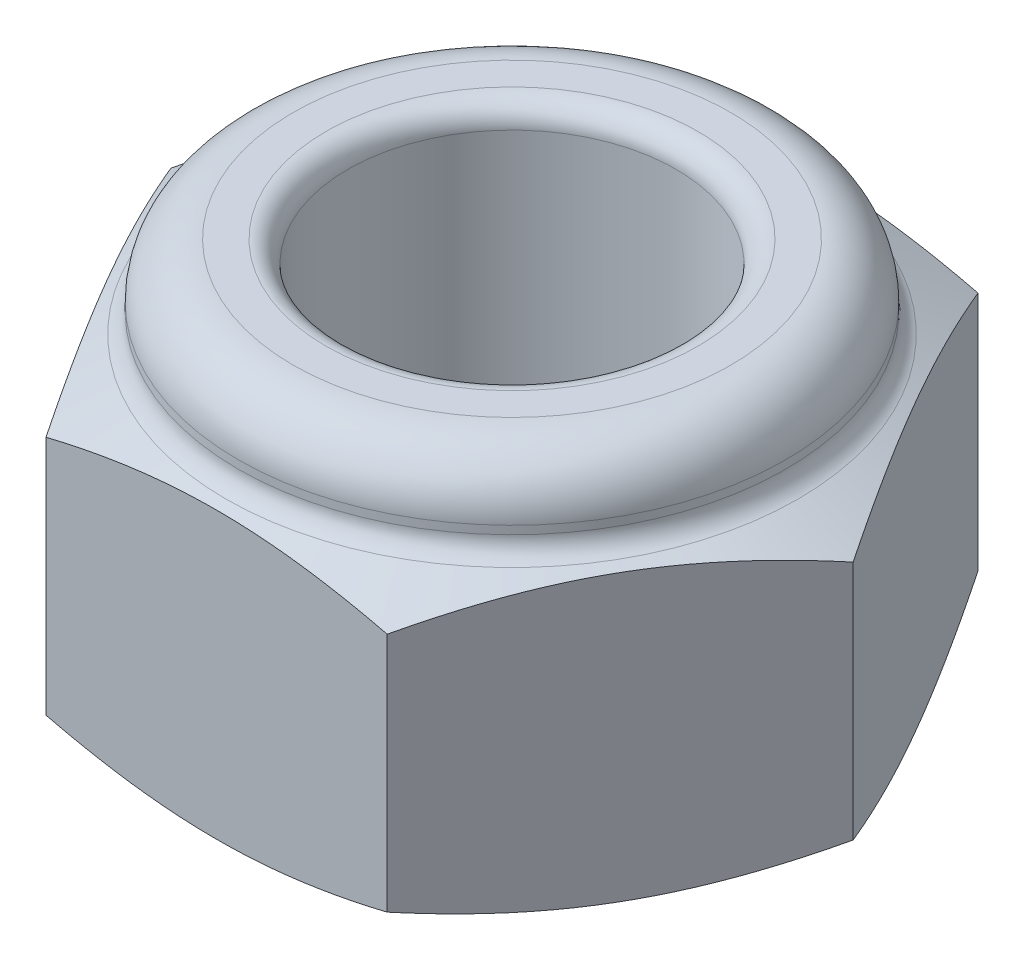
ISO-10303-21;
HEADER;
FILE_DESCRIPTION(('STEP AP214'),'2;1');
FILE_NAME('part.step','',(''),(''),'','','');
FILE_SCHEMA(('AUTOMOTIVE_DESIGN { 1 0 10303 214 1 1 1 1 }'));
ENDSEC;
DATA;
#1=APPLICATION_CONTEXT('core data for automotive mechanical design processes');
#2=APPLICATION_PROTOCOL_DEFINITION('international standard','automotive_design',2000,#1);
#3=PRODUCT_CONTEXT('',#1,'mechanical');
#4=PRODUCT('Part','Part','',(#3));
#5=PRODUCT_RELATED_PRODUCT_CATEGORY('part','',(#4));
#6=PRODUCT_DEFINITION_FORMATION('','',#4);
#7=PRODUCT_DEFINITION_CONTEXT('part definition',#1,'design');
#8=PRODUCT_DEFINITION('design','',#6,#7);
#9=PRODUCT_DEFINITION_SHAPE('','',#8);
#10=(LENGTH_UNIT() NAMED_UNIT(*) SI_UNIT(.MILLI.,.METRE.));
#11=(NAMED_UNIT(*) PLANE_ANGLE_UNIT() SI_UNIT($,.RADIAN.));
#12=(NAMED_UNIT(*) SI_UNIT($,.STERADIAN.) SOLID_ANGLE_UNIT());
#13=UNCERTAINTY_MEASURE_WITH_UNIT(LENGTH_MEASURE(1.E-05),#10,'distance_accuracy_value','');
#14=(GEOMETRIC_REPRESENTATION_CONTEXT(3) GLOBAL_UNCERTAINTY_ASSIGNED_CONTEXT((#13)) GLOBAL_UNIT_ASSIGNED_CONTEXT((#10,
#11,#12)) REPRESENTATION_CONTEXT('',''));
#15=CARTESIAN_POINT('',(0.,0.,0.));
#16=DIRECTION('',(0.,0.,1.));
#17=DIRECTION('',(1.,0.,0.));
#18=AXIS2_PLACEMENT_3D('',#15,#16,#17);
#19=CARTESIAN_POINT('',(1.55884572681199,1.4,2.7));
#20=DIRECTION('',(-0.866025403784439,0.,-0.5));
#21=DIRECTION('',(-0.5,0.,0.866025403784439));
#22=AXIS2_PLACEMENT_3D('',#19,#20,#21);
#23=PLANE('',#22);
#24=CARTESIAN_POINT('',(3.11780692367782,-1.09994391546074,-0.000200000000000864));
#25=CARTESIAN_POINT('',(3.07256028865668,-1.12192030262385,0.0781694707281279));
#26=CARTESIAN_POINT('',(3.02714131524047,-1.14254891267692,0.156837440312636));
#27=CARTESIAN_POINT('',(2.93595040530064,-1.18065333296517,0.314784729516853));
#28=CARTESIAN_POINT('',(2.8901782962198,-1.19812748468401,0.394064348014452));
#29=CARTESIAN_POINT('',(2.79826244016689,-1.22946144459945,0.553267280719281));
#30=CARTESIAN_POINT('',(2.75211829764663,-1.24331667166284,0.633191280036078));
#31=CARTESIAN_POINT('',(2.65957440015918,-1.26693209007472,0.793482012414777));
#32=CARTESIAN_POINT('',(2.61317469231809,-1.27669301238165,0.873848663851907));
#33=CARTESIAN_POINT('',(2.52120907705397,-1.29159532259173,1.03313778203869));
#34=CARTESIAN_POINT('',(2.47564711379912,-1.29683302390061,1.11205341728868));
#35=CARTESIAN_POINT('',(2.38444615418405,-1.30284150252472,1.27001811304101));
#36=CARTESIAN_POINT('',(2.3388071538454,-1.30361204161315,1.34906718043421));
#37=CARTESIAN_POINT('',(2.24761264293103,-1.30065577348523,1.5070207067093));
#38=CARTESIAN_POINT('',(2.20205709465482,-1.29693354152126,1.58592523089034));
#39=CARTESIAN_POINT('',(2.11109193389101,-1.28514782232476,1.74348151105194));
#40=CARTESIAN_POINT('',(2.06568230893312,-1.27708471654445,1.82213328863166));
#41=CARTESIAN_POINT('',(1.98169142278206,-1.25838651295584,1.96760977081801));
#42=CARTESIAN_POINT('',(1.94307921975688,-1.24829730119537,2.03448806824979));
#43=CARTESIAN_POINT('',(1.86605523389241,-1.22541324415785,2.16789752516853));
#44=CARTESIAN_POINT('',(1.82764345852041,-1.21261829880095,2.23442867172175));
#45=CARTESIAN_POINT('',(1.75066867636476,-1.18445557965474,2.36775290531687));
#46=CARTESIAN_POINT('',(1.71210788697121,-1.16906378091678,2.43454215172648));
#47=CARTESIAN_POINT('',(1.63523454688317,-1.13608244562171,2.56769068250648));
#48=CARTESIAN_POINT('',(1.59692191900575,-1.11849363067909,2.63405010056164));
#49=CARTESIAN_POINT('',(1.55873025675815,-1.09994391546075,2.7002));
#50=B_SPLINE_CURVE_WITH_KNOTS('',3,(#24,#25,#26,#27,#28,#29,#30,#31,#32,#33,#34,#35,#36,#37,#38,
#39,#40,#41,#42,#43,#44,#45,#46,#47,#48,#49),.UNSPECIFIED.,.F.,.F.,(4,2,2,2,2,2,2,2,2,2,2,2,4),
(0.,0.279385541508917,0.558917550140784,0.838801717024647,1.11863589474765,1.39235324880075,
1.66608519964082,1.93953862820556,2.2129680311007,2.44655992287335,2.68016045626954,
2.91605430501085,3.15187087666844),.UNSPECIFIED.);
#51=CARTESIAN_POINT('',(3.11769145362398,-1.1,0.));
#52=VERTEX_POINT('',#51);
#53=CARTESIAN_POINT('',(1.55884572681199,-1.1,2.7));
#54=VERTEX_POINT('',#53);
#55=EDGE_CURVE('E48',#52,#54,#50,.T.);
#56=ORIENTED_EDGE('',*,*,#55,.F.);
#57=DIRECTION('',(0.,-1.,0.));
#58=VECTOR('',#57,1.);
#59=CARTESIAN_POINT('',(3.11769145362398,1.4,0.));
#60=LINE('',#59,#58);
#61=CARTESIAN_POINT('',(3.11769145362398,1.1,0.));
#62=VERTEX_POINT('',#61);
#63=EDGE_CURVE('E102',#62,#52,#60,.T.);
#64=ORIENTED_EDGE('',*,*,#63,.F.);
#65=CARTESIAN_POINT('',(1.55873025675815,1.09994391546074,2.7002));
#66=CARTESIAN_POINT('',(1.60397689177929,1.12192030262385,2.62183052927187));
#67=CARTESIAN_POINT('',(1.6493958651955,1.14254891267692,2.54316255968736));
#68=CARTESIAN_POINT('',(1.74058677513533,1.18065333296517,2.38521527048315));
#69=CARTESIAN_POINT('',(1.78635888421617,1.19812748468401,2.30593565198555));
#70=CARTESIAN_POINT('',(1.87827474026908,1.22946144459945,2.14673271928072));
#71=CARTESIAN_POINT('',(1.92441888278934,1.24331667166284,2.06680871996392));
#72=CARTESIAN_POINT('',(2.01696278027679,1.26693209007472,1.90651798758522));
#73=CARTESIAN_POINT('',(2.06336248811788,1.27669301238165,1.82615133614809));
#74=CARTESIAN_POINT('',(2.155328103382,1.29159532259173,1.66686221796131));
#75=CARTESIAN_POINT('',(2.20089006663685,1.29683302390061,1.58794658271132));
#76=CARTESIAN_POINT('',(2.29209102625192,1.30284150252472,1.42998188695899));
#77=CARTESIAN_POINT('',(2.33773002659057,1.30361204161315,1.35093281956579));
#78=CARTESIAN_POINT('',(2.42892453750494,1.30065577348523,1.1929792932907));
#79=CARTESIAN_POINT('',(2.47448008578115,1.29693354152126,1.11407476910966));
#80=CARTESIAN_POINT('',(2.56544524654496,1.28514782232476,0.956518488948062));
#81=CARTESIAN_POINT('',(2.61085487150285,1.27708471654445,0.877866711368344));
#82=CARTESIAN_POINT('',(2.69484575765391,1.25838651295584,0.73239022918199));
#83=CARTESIAN_POINT('',(2.73345796067909,1.24829730119537,0.665511931750207));
#84=CARTESIAN_POINT('',(2.81048194654356,1.22541324415785,0.532102474831471));
#85=CARTESIAN_POINT('',(2.84889372191556,1.21261829880095,0.465571328278254));
#86=CARTESIAN_POINT('',(2.92586850407121,1.18445557965474,0.332247094683126));
#87=CARTESIAN_POINT('',(2.96442929346476,1.16906378091678,0.26545784827352));
#88=CARTESIAN_POINT('',(3.0413026335528,1.13608244562171,0.132309317493521));
#89=CARTESIAN_POINT('',(3.07961526143022,1.11849363067909,0.0659498994383551));
#90=CARTESIAN_POINT('',(3.11780692367782,1.09994391546075,-0.000200000000001502));
#91=B_SPLINE_CURVE_WITH_KNOTS('',3,(#65,#66,#67,#68,#69,#70,#71,#72,#73,#74,#75,#76,#77,#78,#79,
#80,#81,#82,#83,#84,#85,#86,#87,#88,#89,#90),.UNSPECIFIED.,.F.,.F.,(4,2,2,2,2,2,2,2,2,2,2,2,4),
(0.,0.279385541508917,0.558917550140785,0.838801717024647,1.11863589474765,1.39235324880075,
1.66608519964082,1.93953862820556,2.2129680311007,2.44655992287335,2.68016045626954,
2.91605430501085,3.15187087666844),.UNSPECIFIED.);
#92=CARTESIAN_POINT('',(1.55884572681199,1.1,2.7));
#93=VERTEX_POINT('',#92);
#94=EDGE_CURVE('E146',#93,#62,#91,.T.);
#95=ORIENTED_EDGE('',*,*,#94,.F.);
#96=DIRECTION('',(0.,-1.,0.));
#97=VECTOR('',#96,1.);
#98=CARTESIAN_POINT('',(1.55884572681199,1.4,2.7));
#99=LINE('',#98,#97);
#100=EDGE_CURVE('E231',#93,#54,#99,.T.);
#101=ORIENTED_EDGE('',*,*,#100,.T.);
#102=EDGE_LOOP('',(#56,#64,#95,#101));
#103=FACE_BOUND('',#102,.T.);
#104=ADVANCED_FACE('F33',(#103),#23,.F.);
#105=CARTESIAN_POINT('',(3.11769145362398,1.4,0.));
#106=DIRECTION('',(-0.866025403784438,0.,0.5));
#107=DIRECTION('',(0.5,0.,0.866025403784438));
#108=AXIS2_PLACEMENT_3D('',#105,#106,#107);
#109=PLANE('',#108);
#110=CARTESIAN_POINT('',(1.55873025675815,-1.09994391546074,-2.7002));
#111=CARTESIAN_POINT('',(1.60397689177928,-1.12192030262385,-2.62183052927187));
#112=CARTESIAN_POINT('',(1.6493958651955,-1.14254891267692,-2.54316255968736));
#113=CARTESIAN_POINT('',(1.74058677513533,-1.18065333296517,-2.38521527048315));
#114=CARTESIAN_POINT('',(1.78635888421617,-1.19812748468401,-2.30593565198555));
#115=CARTESIAN_POINT('',(1.87827474026908,-1.22946144459945,-2.14673271928072));
#116=CARTESIAN_POINT('',(1.92441888278934,-1.24331667166284,-2.06680871996392));
#117=CARTESIAN_POINT('',(2.01696278027679,-1.26693209007472,-1.90651798758522));
#118=CARTESIAN_POINT('',(2.06336248811788,-1.27669301238165,-1.82615133614809));
#119=CARTESIAN_POINT('',(2.155328103382,-1.29159532259173,-1.66686221796131));
#120=CARTESIAN_POINT('',(2.20089006663685,-1.29683302390061,-1.58794658271132));
#121=CARTESIAN_POINT('',(2.29209102625192,-1.30284150252473,-1.42998188695899));
#122=CARTESIAN_POINT('',(2.33773002659057,-1.30361204161315,-1.35093281956579));
#123=CARTESIAN_POINT('',(2.42892453750494,-1.30065577348523,-1.1929792932907));
#124=CARTESIAN_POINT('',(2.47448008578115,-1.29693354152126,-1.11407476910966));
#125=CARTESIAN_POINT('',(2.56544524654496,-1.28514782232476,-0.956518488948063));
#126=CARTESIAN_POINT('',(2.61085487150285,-1.27708471654445,-0.877866711368345));
#127=CARTESIAN_POINT('',(2.69484575765391,-1.25838651295584,-0.732390229181991));
#128=CARTESIAN_POINT('',(2.73345796067909,-1.24829730119537,-0.665511931750209));
#129=CARTESIAN_POINT('',(2.81048194654356,-1.22541324415785,-0.532102474831473));
#130=CARTESIAN_POINT('',(2.84889372191556,-1.21261829880095,-0.465571328278256));
#131=CARTESIAN_POINT('',(2.92586850407121,-1.18445557965474,-0.332247094683128));
#132=CARTESIAN_POINT('',(2.96442929346476,-1.16906378091678,-0.265457848273522));
#133=CARTESIAN_POINT('',(3.0413026335528,-1.13608244562171,-0.132309317493523));
#134=CARTESIAN_POINT('',(3.07961526143022,-1.11849363067909,-0.0659498994383571));
#135=CARTESIAN_POINT('',(3.11780692367782,-1.09994391546075,0.000199999999999769));
#136=B_SPLINE_CURVE_WITH_KNOTS('',3,(#110,#111,#112,#113,#114,#115,#116,#117,#118,#119,#120,
#121,#122,#123,#124,#125,#126,#127,#128,#129,#130,#131,#132,#133,#134,#135),.UNSPECIFIED.,.F.,
.F.,(4,2,2,2,2,2,2,2,2,2,2,2,4),(0.,0.279385541508917,0.558917550140784,0.838801717024647,
1.11863589474765,1.39235324880074,1.66608519964081,1.93953862820556,2.2129680311007,
2.44655992287335,2.68016045626954,2.91605430501084,3.15187087666844),.UNSPECIFIED.);
#137=CARTESIAN_POINT('',(1.55884572681199,-1.1,-2.7));
#138=VERTEX_POINT('',#137);
#139=EDGE_CURVE('E87',#138,#52,#136,.T.);
#140=ORIENTED_EDGE('',*,*,#139,.F.);
#141=DIRECTION('',(0.,-1.,0.));
#142=VECTOR('',#141,1.);
#143=CARTESIAN_POINT('',(1.55884572681199,1.4,-2.7));
#144=LINE('',#143,#142);
#145=CARTESIAN_POINT('',(1.55884572681199,1.1,-2.7));
#146=VERTEX_POINT('',#145);
#147=EDGE_CURVE('E100',#146,#138,#144,.T.);
#148=ORIENTED_EDGE('',*,*,#147,.F.);
#149=CARTESIAN_POINT('',(3.11780692367782,1.09994391546074,0.000199999999999368));
#150=CARTESIAN_POINT('',(3.07256028865668,1.12192030262385,-0.0781694707281294));
#151=CARTESIAN_POINT('',(3.02714131524047,1.14254891267692,-0.156837440312637));
#152=CARTESIAN_POINT('',(2.93595040530064,1.18065333296517,-0.314784729516854));
#153=CARTESIAN_POINT('',(2.8901782962198,1.19812748468401,-0.394064348014453));
#154=CARTESIAN_POINT('',(2.79826244016689,1.22946144459945,-0.553267280719283));
#155=CARTESIAN_POINT('',(2.75211829764663,1.24331667166284,-0.633191280036079));
#156=CARTESIAN_POINT('',(2.65957440015918,1.26693209007472,-0.793482012414778));
#157=CARTESIAN_POINT('',(2.61317469231809,1.27669301238165,-0.873848663851909));
#158=CARTESIAN_POINT('',(2.52120907705397,1.29159532259173,-1.0331377820387));
#159=CARTESIAN_POINT('',(2.47564711379911,1.29683302390061,-1.11205341728868));
#160=CARTESIAN_POINT('',(2.38444615418405,1.30284150252473,-1.27001811304101));
#161=CARTESIAN_POINT('',(2.3388071538454,1.30361204161315,-1.34906718043422));
#162=CARTESIAN_POINT('',(2.24761264293103,1.30065577348523,-1.5070207067093));
#163=CARTESIAN_POINT('',(2.20205709465482,1.29693354152126,-1.58592523089034));
#164=CARTESIAN_POINT('',(2.11109193389101,1.28514782232476,-1.74348151105194));
#165=CARTESIAN_POINT('',(2.06568230893311,1.27708471654445,-1.82213328863166));
#166=CARTESIAN_POINT('',(1.98169142278206,1.25838651295584,-1.96760977081801));
#167=CARTESIAN_POINT('',(1.94307921975688,1.24829730119537,-2.03448806824979));
#168=CARTESIAN_POINT('',(1.86605523389241,1.22541324415785,-2.16789752516853));
#169=CARTESIAN_POINT('',(1.82764345852041,1.21261829880095,-2.23442867172175));
#170=CARTESIAN_POINT('',(1.75066867636476,1.18445557965474,-2.36775290531687));
#171=CARTESIAN_POINT('',(1.71210788697121,1.16906378091678,-2.43454215172648));
#172=CARTESIAN_POINT('',(1.63523454688317,1.13608244562171,-2.56769068250648));
#173=CARTESIAN_POINT('',(1.59692191900575,1.11849363067909,-2.63405010056164));
#174=CARTESIAN_POINT('',(1.55873025675815,1.09994391546075,-2.7002));
#175=B_SPLINE_CURVE_WITH_KNOTS('',3,(#149,#150,#151,#152,#153,#154,#155,#156,#157,#158,#159,
#160,#161,#162,#163,#164,#165,#166,#167,#168,#169,#170,#171,#172,#173,#174),.UNSPECIFIED.,.F.,
.F.,(4,2,2,2,2,2,2,2,2,2,2,2,4),(0.,0.279385541508917,0.558917550140784,0.838801717024648,
1.11863589474765,1.39235324880075,1.66608519964082,1.93953862820556,2.2129680311007,
2.44655992287335,2.68016045626954,2.91605430501084,3.15187087666844),.UNSPECIFIED.);
#176=EDGE_CURVE('E221',#62,#146,#175,.T.);
#177=ORIENTED_EDGE('',*,*,#176,.F.);
#178=ORIENTED_EDGE('',*,*,#63,.T.);
#179=EDGE_LOOP('',(#140,#148,#177,#178));
#180=FACE_BOUND('',#179,.T.);
#181=ADVANCED_FACE('F98',(#180),#109,.F.);
#182=CARTESIAN_POINT('',(1.55884572681199,1.4,-2.7));
#183=DIRECTION('',(0.,0.,1.));
#184=DIRECTION('',(1.,0.,0.));
#185=AXIS2_PLACEMENT_3D('',#182,#183,#184);
#186=PLANE('',#185);
#187=CARTESIAN_POINT('',(-4.69113767948515,0.0146137083795435,-2.7));
#188=CARTESIAN_POINT('',(-4.55468747732765,-0.0428071602979565,-2.7));
#189=CARTESIAN_POINT('',(-4.41802239054629,-0.0997259467058353,-2.7));
#190=CARTESIAN_POINT('',(-4.14413431800298,-0.212248994777574,-2.7));
#191=CARTESIAN_POINT('',(-4.00691126981511,-0.267853104329405,-2.7));
#192=CARTESIAN_POINT('',(-3.73131800682273,-0.377619230758513,-2.7));
#193=CARTESIAN_POINT('',(-3.59294544377368,-0.431775371253652,-2.7));
#194=CARTESIAN_POINT('',(-3.31539674486345,-0.537980683947498,-2.7));
#195=CARTESIAN_POINT('',(-3.17622063657551,-0.590029927958033,-2.7));
#196=CARTESIAN_POINT('',(-2.89745778983694,-0.691207619077893,-2.7));
#197=CARTESIAN_POINT('',(-2.75787514043473,-0.740347271943029,-2.7));
#198=CARTESIAN_POINT('',(-2.47751012828499,-0.8351317487188,-2.7));
#199=CARTESIAN_POINT('',(-2.33672768068775,-0.880776323139671,-2.7));
#200=CARTESIAN_POINT('',(-2.05386412158284,-0.967442259910974,-2.7));
#201=CARTESIAN_POINT('',(-1.91178426862915,-1.00846767503729,-2.7));
#202=CARTESIAN_POINT('',(-1.62605040318147,-1.08452089412323,-2.7));
#203=CARTESIAN_POINT('',(-1.48239666738035,-1.11954973485076,-2.7));
#204=CARTESIAN_POINT('',(-1.14083641452659,-1.19318445404867,-2.7));
#205=CARTESIAN_POINT('',(-0.942170311485041,-1.22847087037316,-2.7));
#206=CARTESIAN_POINT('',(-0.642434964040471,-1.26706851937335,-2.7));
#207=CARTESIAN_POINT('',(-0.542272946980121,-1.27754445347769,-2.7));
#208=CARTESIAN_POINT('',(-0.341532054065742,-1.29328911490717,-2.7));
#209=CARTESIAN_POINT('',(-0.240953187924242,-1.2985579628794,-2.7));
#210=CARTESIAN_POINT('',(-0.0397183499847793,-1.30363007169235,-2.7));
#211=CARTESIAN_POINT('',(0.0609375370085431,-1.30343667399282,-2.7));
#212=CARTESIAN_POINT('',(0.26208975057184,-1.29760326538065,-2.7));
#213=CARTESIAN_POINT('',(0.362586076036933,-1.29196321691611,-2.7));
#214=CARTESIAN_POINT('',(0.563218857218127,-1.27549946871654,-2.7));
#215=CARTESIAN_POINT('',(0.663355008872786,-1.26467211314156,-2.7));
#216=CARTESIAN_POINT('',(0.86300881533064,-1.2382979795293,-2.7));
#217=CARTESIAN_POINT('',(0.962526376134903,-1.22275050130456,-2.7));
#218=CARTESIAN_POINT('',(1.21794777486023,-1.17735578612481,-2.7));
#219=CARTESIAN_POINT('',(1.373304245304,-1.14443068445732,-2.7));
#220=CARTESIAN_POINT('',(1.68210258926081,-1.07058061440098,-2.7));
#221=CARTESIAN_POINT('',(1.83554386139707,-1.02965319731164,-2.7));
#222=CARTESIAN_POINT('',(2.14099571520461,-0.941689757380214,-2.7));
#223=CARTESIAN_POINT('',(2.29300259402951,-0.894641024869303,-2.7));
#224=CARTESIAN_POINT('',(2.59551288665667,-0.796036354432129,-2.7));
#225=CARTESIAN_POINT('',(2.74601647302029,-0.744480940605079,-2.7));
#226=CARTESIAN_POINT('',(3.04789046875134,-0.637244652095412,-2.7));
#227=CARTESIAN_POINT('',(3.19924397946193,-0.581516501365703,-2.7));
#228=CARTESIAN_POINT('',(3.50095709426521,-0.467421134591493,-2.7));
#229=CARTESIAN_POINT('',(3.65131664767578,-0.409053785145371,-2.7));
#230=CARTESIAN_POINT('',(3.95029254085544,-0.290673618723429,-2.7));
#231=CARTESIAN_POINT('',(4.09891389878789,-0.230673425321061,-2.7));
#232=CARTESIAN_POINT('',(4.39548599142938,-0.109104685009477,-2.7));
#233=CARTESIAN_POINT('',(4.54343683272577,-0.0475363984628555,-2.7));
#234=CARTESIAN_POINT('',(4.69113767948515,0.0146137083795442,-2.7));
#235=B_SPLINE_CURVE_WITH_KNOTS('',3,(#187,#188,#189,#190,#191,#192,#193,#194,#195,#196,#197,
#198,#199,#200,#201,#202,#203,#204,#205,#206,#207,#208,#209,#210,#211,#212,#213,#214,#215,#216,
#217,#218,#219,#220,#221,#222,#223,#224,#225,#226,#227,#228,#229,#230,#231,#232,#233,#234),
.UNSPECIFIED.,.F.,.F.,(4,2,2,2,2,2,2,2,2,2,2,2,2,2,2,2,2,2,2,2,2,2,2,4),(0.,0.444123678734628,
0.888298494895089,1.33406370933169,1.77981371741346,2.22371728923289,2.66765251881139,
3.1111951605473,3.55466103908647,4.15914990134108,4.461160470823,4.76316404261981,
5.06498287155266,5.36680378138888,5.66883771808473,5.97091648069084,6.44703576594981,
6.92330097188916,7.40057131594465,7.87778623005908,8.36161550819059,8.84546926947997,
9.32628684560132,9.80702510173027),.UNSPECIFIED.);
#236=CARTESIAN_POINT('',(-1.55884572681199,-1.1,-2.7));
#237=VERTEX_POINT('',#236);
#238=EDGE_CURVE('E84',#237,#138,#235,.T.);
#239=ORIENTED_EDGE('',*,*,#238,.F.);
#240=DIRECTION('',(0.,-1.,0.));
#241=VECTOR('',#240,1.);
#242=CARTESIAN_POINT('',(-1.55884572681199,1.4,-2.7));
#243=LINE('',#242,#241);
#244=CARTESIAN_POINT('',(-1.55884572681199,1.1,-2.7));
#245=VERTEX_POINT('',#244);
#246=EDGE_CURVE('E107',#245,#237,#243,.T.);
#247=ORIENTED_EDGE('',*,*,#246,.F.);
#248=CARTESIAN_POINT('',(4.69113767948515,-0.0146137083795435,-2.7));
#249=CARTESIAN_POINT('',(4.55468747732765,0.0428071602979565,-2.7));
#250=CARTESIAN_POINT('',(4.41802239054629,0.0997259467058353,-2.7));
#251=CARTESIAN_POINT('',(4.14413431800298,0.212248994777574,-2.7));
#252=CARTESIAN_POINT('',(4.00691126981511,0.267853104329405,-2.7));
#253=CARTESIAN_POINT('',(3.73131800682273,0.377619230758513,-2.7));
#254=CARTESIAN_POINT('',(3.59294544377368,0.431775371253652,-2.7));
#255=CARTESIAN_POINT('',(3.31539674486345,0.537980683947498,-2.7));
#256=CARTESIAN_POINT('',(3.17622063657551,0.590029927958033,-2.7));
#257=CARTESIAN_POINT('',(2.89745778983694,0.691207619077893,-2.7));
#258=CARTESIAN_POINT('',(2.75787514043473,0.740347271943029,-2.7));
#259=CARTESIAN_POINT('',(2.47751012828499,0.8351317487188,-2.7));
#260=CARTESIAN_POINT('',(2.33672768068775,0.880776323139671,-2.7));
#261=CARTESIAN_POINT('',(2.05386412158284,0.967442259910974,-2.7));
#262=CARTESIAN_POINT('',(1.91178426862915,1.00846767503729,-2.7));
#263=CARTESIAN_POINT('',(1.62605040318147,1.08452089412323,-2.7));
#264=CARTESIAN_POINT('',(1.48239666738035,1.11954973485076,-2.7));
#265=CARTESIAN_POINT('',(1.14083641452659,1.19318445404867,-2.7));
#266=CARTESIAN_POINT('',(0.942170311485041,1.22847087037316,-2.7));
#267=CARTESIAN_POINT('',(0.642434964040471,1.26706851937335,-2.7));
#268=CARTESIAN_POINT('',(0.542272946980121,1.27754445347769,-2.7));
#269=CARTESIAN_POINT('',(0.341532054065742,1.29328911490717,-2.7));
#270=CARTESIAN_POINT('',(0.240953187924242,1.2985579628794,-2.7));
#271=CARTESIAN_POINT('',(0.0397183499847793,1.30363007169235,-2.7));
#272=CARTESIAN_POINT('',(-0.0609375370085431,1.30343667399282,-2.7));
#273=CARTESIAN_POINT('',(-0.26208975057184,1.29760326538065,-2.7));
#274=CARTESIAN_POINT('',(-0.362586076036933,1.29196321691611,-2.7));
#275=CARTESIAN_POINT('',(-0.563218857218127,1.27549946871654,-2.7));
#276=CARTESIAN_POINT('',(-0.663355008872786,1.26467211314156,-2.7));
#277=CARTESIAN_POINT('',(-0.86300881533064,1.2382979795293,-2.7));
#278=CARTESIAN_POINT('',(-0.962526376134903,1.22275050130456,-2.7));
#279=CARTESIAN_POINT('',(-1.21794777486023,1.17735578612481,-2.7));
#280=CARTESIAN_POINT('',(-1.373304245304,1.14443068445732,-2.7));
#281=CARTESIAN_POINT('',(-1.68210258926081,1.07058061440098,-2.7));
#282=CARTESIAN_POINT('',(-1.83554386139707,1.02965319731164,-2.7));
#283=CARTESIAN_POINT('',(-2.14099571520461,0.941689757380214,-2.7));
#284=CARTESIAN_POINT('',(-2.29300259402951,0.894641024869303,-2.7));
#285=CARTESIAN_POINT('',(-2.59551288665667,0.796036354432129,-2.7));
#286=CARTESIAN_POINT('',(-2.74601647302029,0.744480940605079,-2.7));
#287=CARTESIAN_POINT('',(-3.04789046875134,0.637244652095412,-2.7));
#288=CARTESIAN_POINT('',(-3.19924397946193,0.581516501365703,-2.7));
#289=CARTESIAN_POINT('',(-3.50095709426521,0.467421134591493,-2.7));
#290=CARTESIAN_POINT('',(-3.65131664767578,0.409053785145371,-2.7));
#291=CARTESIAN_POINT('',(-3.95029254085544,0.290673618723429,-2.7));
#292=CARTESIAN_POINT('',(-4.09891389878789,0.230673425321061,-2.7));
#293=CARTESIAN_POINT('',(-4.39548599142938,0.109104685009477,-2.7));
#294=CARTESIAN_POINT('',(-4.54343683272577,0.0475363984628555,-2.7));
#295=CARTESIAN_POINT('',(-4.69113767948515,-0.0146137083795442,-2.7));
#296=B_SPLINE_CURVE_WITH_KNOTS('',3,(#248,#249,#250,#251,#252,#253,#254,#255,#256,#257,#258,
#259,#260,#261,#262,#263,#264,#265,#266,#267,#268,#269,#270,#271,#272,#273,#274,#275,#276,#277,
#278,#279,#280,#281,#282,#283,#284,#285,#286,#287,#288,#289,#290,#291,#292,#293,#294,#295),
.UNSPECIFIED.,.F.,.F.,(4,2,2,2,2,2,2,2,2,2,2,2,2,2,2,2,2,2,2,2,2,2,2,4),(0.,0.444123678734628,
0.888298494895089,1.33406370933169,1.77981371741346,2.22371728923289,2.66765251881139,
3.1111951605473,3.55466103908647,4.15914990134108,4.461160470823,4.76316404261981,
5.06498287155266,5.36680378138888,5.66883771808473,5.97091648069084,6.44703576594981,
6.92330097188916,7.40057131594465,7.87778623005908,8.36161550819059,8.84546926947997,
9.32628684560132,9.80702510173027),.UNSPECIFIED.);
#297=EDGE_CURVE('E106',#146,#245,#296,.T.);
#298=ORIENTED_EDGE('',*,*,#297,.F.);
#299=ORIENTED_EDGE('',*,*,#147,.T.);
#300=EDGE_LOOP('',(#239,#247,#298,#299));
#301=FACE_BOUND('',#300,.T.);
#302=ADVANCED_FACE('F105',(#301),#186,.F.);
#303=CARTESIAN_POINT('',(-1.55884572681199,1.4,-2.7));
#304=DIRECTION('',(0.866025403784439,0.,0.5));
#305=DIRECTION('',(0.5,0.,-0.866025403784439));
#306=AXIS2_PLACEMENT_3D('',#303,#304,#305);
#307=PLANE('',#306);
#308=CARTESIAN_POINT('',(-3.11780692367782,-1.09994391546074,0.000199999999999775));
#309=CARTESIAN_POINT('',(-3.07256028865668,-1.12192030262385,-0.0781694707281291));
#310=CARTESIAN_POINT('',(-3.02714131524047,-1.14254891267692,-0.156837440312637));
#311=CARTESIAN_POINT('',(-2.93595040530064,-1.18065333296517,-0.314784729516854));
#312=CARTESIAN_POINT('',(-2.8901782962198,-1.19812748468401,-0.394064348014453));
#313=CARTESIAN_POINT('',(-2.79826244016689,-1.22946144459945,-0.553267280719282));
#314=CARTESIAN_POINT('',(-2.75211829764663,-1.24331667166284,-0.633191280036078));
#315=CARTESIAN_POINT('',(-2.65957440015918,-1.26693209007472,-0.793482012414778));
#316=CARTESIAN_POINT('',(-2.61317469231809,-1.27669301238165,-0.873848663851908));
#317=CARTESIAN_POINT('',(-2.52120907705397,-1.29159532259173,-1.03313778203869));
#318=CARTESIAN_POINT('',(-2.47564711379911,-1.29683302390061,-1.11205341728868));
#319=CARTESIAN_POINT('',(-2.38444615418405,-1.30284150252473,-1.27001811304101));
#320=CARTESIAN_POINT('',(-2.3388071538454,-1.30361204161315,-1.34906718043422));
#321=CARTESIAN_POINT('',(-2.24761264293103,-1.30065577348523,-1.5070207067093));
#322=CARTESIAN_POINT('',(-2.20205709465482,-1.29693354152126,-1.58592523089034));
#323=CARTESIAN_POINT('',(-2.11109193389101,-1.28514782232476,-1.74348151105194));
#324=CARTESIAN_POINT('',(-2.06568230893311,-1.27708471654445,-1.82213328863166));
#325=CARTESIAN_POINT('',(-1.98169142278206,-1.25838651295584,-1.96760977081801));
#326=CARTESIAN_POINT('',(-1.94307921975688,-1.24829730119537,-2.03448806824979));
#327=CARTESIAN_POINT('',(-1.86605523389241,-1.22541324415785,-2.16789752516853));
#328=CARTESIAN_POINT('',(-1.82764345852041,-1.21261829880095,-2.23442867172175));
#329=CARTESIAN_POINT('',(-1.75066867636476,-1.18445557965474,-2.36775290531687));
#330=CARTESIAN_POINT('',(-1.7121078869712,-1.16906378091678,-2.43454215172648));
#331=CARTESIAN_POINT('',(-1.63523454688317,-1.13608244562171,-2.56769068250648));
#332=CARTESIAN_POINT('',(-1.59692191900575,-1.11849363067909,-2.63405010056164));
#333=CARTESIAN_POINT('',(-1.55873025675815,-1.09994391546075,-2.7002));
#334=B_SPLINE_CURVE_WITH_KNOTS('',3,(#308,#309,#310,#311,#312,#313,#314,#315,#316,#317,#318,
#319,#320,#321,#322,#323,#324,#325,#326,#327,#328,#329,#330,#331,#332,#333),.UNSPECIFIED.,.F.,
.F.,(4,2,2,2,2,2,2,2,2,2,2,2,4),(0.,0.279385541508918,0.558917550140784,0.838801717024647,
1.11863589474765,1.39235324880075,1.66608519964082,1.93953862820556,2.2129680311007,
2.44655992287335,2.68016045626954,2.91605430501084,3.15187087666844),.UNSPECIFIED.);
#335=CARTESIAN_POINT('',(-3.11769145362398,-1.1,0.));
#336=VERTEX_POINT('',#335);
#337=EDGE_CURVE('E89',#336,#237,#334,.T.);
#338=ORIENTED_EDGE('',*,*,#337,.F.);
#339=DIRECTION('',(0.,-1.,0.));
#340=VECTOR('',#339,1.);
#341=CARTESIAN_POINT('',(-3.11769145362398,1.4,0.));
#342=LINE('',#341,#340);
#343=CARTESIAN_POINT('',(-3.11769145362398,1.1,0.));
#344=VERTEX_POINT('',#343);
#345=EDGE_CURVE('E111',#344,#336,#342,.T.);
#346=ORIENTED_EDGE('',*,*,#345,.F.);
#347=CARTESIAN_POINT('',(-1.55873025675815,1.09994391546074,-2.7002));
#348=CARTESIAN_POINT('',(-1.60397689177928,1.12192030262385,-2.62183052927187));
#349=CARTESIAN_POINT('',(-1.6493958651955,1.14254891267692,-2.54316255968736));
#350=CARTESIAN_POINT('',(-1.74058677513533,1.18065333296517,-2.38521527048315));
#351=CARTESIAN_POINT('',(-1.78635888421617,1.19812748468401,-2.30593565198555));
#352=CARTESIAN_POINT('',(-1.87827474026908,1.22946144459945,-2.14673271928072));
#353=CARTESIAN_POINT('',(-1.92441888278934,1.24331667166284,-2.06680871996392));
#354=CARTESIAN_POINT('',(-2.01696278027679,1.26693209007472,-1.90651798758522));
#355=CARTESIAN_POINT('',(-2.06336248811788,1.27669301238165,-1.82615133614809));
#356=CARTESIAN_POINT('',(-2.155328103382,1.29159532259173,-1.66686221796131));
#357=CARTESIAN_POINT('',(-2.20089006663685,1.29683302390061,-1.58794658271132));
#358=CARTESIAN_POINT('',(-2.29209102625192,1.30284150252473,-1.42998188695899));
#359=CARTESIAN_POINT('',(-2.33773002659057,1.30361204161315,-1.35093281956579));
#360=CARTESIAN_POINT('',(-2.42892453750494,1.30065577348523,-1.1929792932907));
#361=CARTESIAN_POINT('',(-2.47448008578115,1.29693354152126,-1.11407476910966));
#362=CARTESIAN_POINT('',(-2.56544524654496,1.28514782232476,-0.956518488948064));
#363=CARTESIAN_POINT('',(-2.61085487150285,1.27708471654445,-0.877866711368346));
#364=CARTESIAN_POINT('',(-2.69484575765391,1.25838651295584,-0.732390229181991));
#365=CARTESIAN_POINT('',(-2.73345796067909,1.24829730119537,-0.665511931750209));
#366=CARTESIAN_POINT('',(-2.81048194654356,1.22541324415785,-0.532102474831473));
#367=CARTESIAN_POINT('',(-2.84889372191556,1.21261829880095,-0.465571328278255));
#368=CARTESIAN_POINT('',(-2.9258685040712,1.18445557965474,-0.332247094683127));
#369=CARTESIAN_POINT('',(-2.96442929346476,1.16906378091678,-0.265457848273521));
#370=CARTESIAN_POINT('',(-3.0413026335528,1.13608244562171,-0.132309317493523));
#371=CARTESIAN_POINT('',(-3.07961526143022,1.11849363067909,-0.0659498994383563));
#372=CARTESIAN_POINT('',(-3.11780692367782,1.09994391546075,0.000200000000000746));
#373=B_SPLINE_CURVE_WITH_KNOTS('',3,(#347,#348,#349,#350,#351,#352,#353,#354,#355,#356,#357,
#358,#359,#360,#361,#362,#363,#364,#365,#366,#367,#368,#369,#370,#371,#372),.UNSPECIFIED.,.F.,
.F.,(4,2,2,2,2,2,2,2,2,2,2,2,4),(0.,0.279385541508917,0.558917550140784,0.838801717024647,
1.11863589474765,1.39235324880074,1.66608519964081,1.93953862820556,2.2129680311007,
2.44655992287335,2.68016045626954,2.91605430501084,3.15187087666845),.UNSPECIFIED.);
#374=EDGE_CURVE('E222',#245,#344,#373,.T.);
#375=ORIENTED_EDGE('',*,*,#374,.F.);
#376=ORIENTED_EDGE('',*,*,#246,.T.);
#377=EDGE_LOOP('',(#338,#346,#375,#376));
#378=FACE_BOUND('',#377,.T.);
#379=ADVANCED_FACE('F212',(#378),#307,.F.);
#380=CARTESIAN_POINT('',(-3.11769145362398,1.4,0.));
#381=DIRECTION('',(0.866025403784438,0.,-0.5));
#382=DIRECTION('',(-0.5,0.,-0.866025403784439));
#383=AXIS2_PLACEMENT_3D('',#380,#381,#382);
#384=PLANE('',#383);
#385=CARTESIAN_POINT('',(-1.55873025675815,-1.09994391546074,2.7002));
#386=CARTESIAN_POINT('',(-1.60397689177928,-1.12192030262385,2.62183052927187));
#387=CARTESIAN_POINT('',(-1.6493958651955,-1.14254891267692,2.54316255968736));
#388=CARTESIAN_POINT('',(-1.74058677513533,-1.18065333296517,2.38521527048315));
#389=CARTESIAN_POINT('',(-1.78635888421617,-1.19812748468401,2.30593565198555));
#390=CARTESIAN_POINT('',(-1.87827474026908,-1.22946144459945,2.14673271928072));
#391=CARTESIAN_POINT('',(-1.92441888278934,-1.24331667166284,2.06680871996392));
#392=CARTESIAN_POINT('',(-2.01696278027679,-1.26693209007472,1.90651798758522));
#393=CARTESIAN_POINT('',(-2.06336248811788,-1.27669301238165,1.82615133614809));
#394=CARTESIAN_POINT('',(-2.155328103382,-1.29159532259173,1.66686221796131));
#395=CARTESIAN_POINT('',(-2.20089006663685,-1.29683302390061,1.58794658271132));
#396=CARTESIAN_POINT('',(-2.29209102625191,-1.30284150252473,1.42998188695899));
#397=CARTESIAN_POINT('',(-2.33773002659057,-1.30361204161315,1.35093281956579));
#398=CARTESIAN_POINT('',(-2.42892453750494,-1.30065577348523,1.1929792932907));
#399=CARTESIAN_POINT('',(-2.47448008578115,-1.29693354152126,1.11407476910966));
#400=CARTESIAN_POINT('',(-2.56544524654496,-1.28514782232476,0.956518488948064));
#401=CARTESIAN_POINT('',(-2.61085487150285,-1.27708471654445,0.877866711368346));
#402=CARTESIAN_POINT('',(-2.6948457576539,-1.25838651295584,0.732390229181991));
#403=CARTESIAN_POINT('',(-2.73345796067909,-1.24829730119537,0.665511931750209));
#404=CARTESIAN_POINT('',(-2.81048194654356,-1.22541324415785,0.532102474831473));
#405=CARTESIAN_POINT('',(-2.84889372191556,-1.21261829880095,0.465571328278255));
#406=CARTESIAN_POINT('',(-2.9258685040712,-1.18445557965474,0.332247094683127));
#407=CARTESIAN_POINT('',(-2.96442929346476,-1.16906378091678,0.265457848273521));
#408=CARTESIAN_POINT('',(-3.0413026335528,-1.13608244562171,0.132309317493522));
#409=CARTESIAN_POINT('',(-3.07961526143022,-1.11849363067909,0.0659498994383554));
#410=CARTESIAN_POINT('',(-3.11780692367782,-1.09994391546075,-0.000200000000001266));
#411=B_SPLINE_CURVE_WITH_KNOTS('',3,(#385,#386,#387,#388,#389,#390,#391,#392,#393,#394,#395,
#396,#397,#398,#399,#400,#401,#402,#403,#404,#405,#406,#407,#408,#409,#410),.UNSPECIFIED.,.F.,
.F.,(4,2,2,2,2,2,2,2,2,2,2,2,4),(0.,0.279385541508917,0.558917550140784,0.838801717024646,
1.11863589474765,1.39235324880074,1.66608519964081,1.93953862820556,2.2129680311007,
2.44655992287334,2.68016045626954,2.91605430501084,3.15187087666845),.UNSPECIFIED.);
#412=CARTESIAN_POINT('',(-1.55884572681199,-1.1,2.7));
#413=VERTEX_POINT('',#412);
#414=EDGE_CURVE('E193',#413,#336,#411,.T.);
#415=ORIENTED_EDGE('',*,*,#414,.F.);
#416=DIRECTION('',(0.,-1.,0.));
#417=VECTOR('',#416,1.);
#418=CARTESIAN_POINT('',(-1.55884572681199,1.4,2.7));
#419=LINE('',#418,#417);
#420=CARTESIAN_POINT('',(-1.55884572681199,1.1,2.7));
#421=VERTEX_POINT('',#420);
#422=EDGE_CURVE('E234',#421,#413,#419,.T.);
#423=ORIENTED_EDGE('',*,*,#422,.F.);
#424=CARTESIAN_POINT('',(-3.11780692367782,1.09994391546074,-0.000200000000000454));
#425=CARTESIAN_POINT('',(-3.07256028865668,1.12192030262385,0.0781694707281284));
#426=CARTESIAN_POINT('',(-3.02714131524047,1.14254891267692,0.156837440312636));
#427=CARTESIAN_POINT('',(-2.93595040530064,1.18065333296517,0.314784729516853));
#428=CARTESIAN_POINT('',(-2.8901782962198,1.19812748468401,0.394064348014452));
#429=CARTESIAN_POINT('',(-2.79826244016689,1.22946144459945,0.553267280719282));
#430=CARTESIAN_POINT('',(-2.75211829764663,1.24331667166284,0.633191280036078));
#431=CARTESIAN_POINT('',(-2.65957440015918,1.26693209007472,0.793482012414777));
#432=CARTESIAN_POINT('',(-2.61317469231808,1.27669301238165,0.873848663851907));
#433=CARTESIAN_POINT('',(-2.52120907705397,1.29159532259173,1.03313778203869));
#434=CARTESIAN_POINT('',(-2.47564711379911,1.29683302390061,1.11205341728868));
#435=CARTESIAN_POINT('',(-2.38444615418405,1.30284150252473,1.27001811304101));
#436=CARTESIAN_POINT('',(-2.3388071538454,1.30361204161315,1.34906718043421));
#437=CARTESIAN_POINT('',(-2.24761264293102,1.30065577348523,1.5070207067093));
#438=CARTESIAN_POINT('',(-2.20205709465482,1.29693354152126,1.58592523089034));
#439=CARTESIAN_POINT('',(-2.11109193389101,1.28514782232476,1.74348151105194));
#440=CARTESIAN_POINT('',(-2.06568230893311,1.27708471654445,1.82213328863166));
#441=CARTESIAN_POINT('',(-1.98169142278206,1.25838651295584,1.96760977081801));
#442=CARTESIAN_POINT('',(-1.94307921975688,1.24829730119537,2.03448806824979));
#443=CARTESIAN_POINT('',(-1.86605523389241,1.22541324415785,2.16789752516853));
#444=CARTESIAN_POINT('',(-1.82764345852041,1.21261829880095,2.23442867172175));
#445=CARTESIAN_POINT('',(-1.75066867636476,1.18445557965474,2.36775290531687));
#446=CARTESIAN_POINT('',(-1.7121078869712,1.16906378091678,2.43454215172648));
#447=CARTESIAN_POINT('',(-1.63523454688317,1.13608244562171,2.56769068250648));
#448=CARTESIAN_POINT('',(-1.59692191900575,1.11849363067909,2.63405010056164));
#449=CARTESIAN_POINT('',(-1.55873025675815,1.09994391546075,2.7002));
#450=B_SPLINE_CURVE_WITH_KNOTS('',3,(#424,#425,#426,#427,#428,#429,#430,#431,#432,#433,#434,
#435,#436,#437,#438,#439,#440,#441,#442,#443,#444,#445,#446,#447,#448,#449),.UNSPECIFIED.,.F.,
.F.,(4,2,2,2,2,2,2,2,2,2,2,2,4),(0.,0.279385541508917,0.558917550140784,0.838801717024647,
1.11863589474765,1.39235324880075,1.66608519964082,1.93953862820556,2.2129680311007,
2.44655992287335,2.68016045626954,2.91605430501084,3.15187087666844),.UNSPECIFIED.);
#451=EDGE_CURVE('E56',#344,#421,#450,.T.);
#452=ORIENTED_EDGE('',*,*,#451,.F.);
#453=ORIENTED_EDGE('',*,*,#345,.T.);
#454=EDGE_LOOP('',(#415,#423,#452,#453));
#455=FACE_BOUND('',#454,.T.);
#456=ADVANCED_FACE('F242',(#455),#384,.F.);
#457=CARTESIAN_POINT('',(-1.55884572681199,1.4,2.7));
#458=DIRECTION('',(0.,0.,-1.));
#459=DIRECTION('',(-1.,0.,0.));
#460=AXIS2_PLACEMENT_3D('',#457,#458,#459);
#461=PLANE('',#460);
#462=CARTESIAN_POINT('',(4.69113767948515,0.0146137083795446,2.7));
#463=CARTESIAN_POINT('',(4.55468747732765,-0.0428071602979555,2.7));
#464=CARTESIAN_POINT('',(4.4180223905463,-0.0997259467058344,2.7));
#465=CARTESIAN_POINT('',(4.14413431800298,-0.212248994777574,2.7));
#466=CARTESIAN_POINT('',(4.00691126981511,-0.267853104329405,2.7));
#467=CARTESIAN_POINT('',(3.73131800682273,-0.377619230758513,2.7));
#468=CARTESIAN_POINT('',(3.59294544377368,-0.431775371253652,2.7));
#469=CARTESIAN_POINT('',(3.31539674486345,-0.537980683947498,2.7));
#470=CARTESIAN_POINT('',(3.17622063657551,-0.590029927958033,2.7));
#471=CARTESIAN_POINT('',(2.89745778983694,-0.691207619077892,2.7));
#472=CARTESIAN_POINT('',(2.75787514043472,-0.740347271943029,2.7));
#473=CARTESIAN_POINT('',(2.47751012828499,-0.8351317487188,2.7));
#474=CARTESIAN_POINT('',(2.33672768068775,-0.880776323139671,2.7));
#475=CARTESIAN_POINT('',(2.05386412158284,-0.967442259910973,2.7));
#476=CARTESIAN_POINT('',(1.91178426862915,-1.00846767503729,2.7));
#477=CARTESIAN_POINT('',(1.62605040318147,-1.08452089412323,2.7));
#478=CARTESIAN_POINT('',(1.48239666738035,-1.11954973485076,2.7));
#479=CARTESIAN_POINT('',(1.14083641452659,-1.19318445404867,2.7));
#480=CARTESIAN_POINT('',(0.942170311485041,-1.22847087037316,2.7));
#481=CARTESIAN_POINT('',(0.642434964040471,-1.26706851937335,2.7));
#482=CARTESIAN_POINT('',(0.542272946980121,-1.27754445347769,2.7));
#483=CARTESIAN_POINT('',(0.341532054065742,-1.29328911490717,2.7));
#484=CARTESIAN_POINT('',(0.240953187924243,-1.2985579628794,2.7));
#485=CARTESIAN_POINT('',(0.0397183499847797,-1.30363007169235,2.7));
#486=CARTESIAN_POINT('',(-0.0609375370085429,-1.30343667399282,2.7));
#487=CARTESIAN_POINT('',(-0.26208975057184,-1.29760326538065,2.7));
#488=CARTESIAN_POINT('',(-0.362586076036932,-1.29196321691611,2.7));
#489=CARTESIAN_POINT('',(-0.563218857218126,-1.27549946871654,2.7));
#490=CARTESIAN_POINT('',(-0.663355008872786,-1.26467211314156,2.7));
#491=CARTESIAN_POINT('',(-0.86300881533064,-1.2382979795293,2.7));
#492=CARTESIAN_POINT('',(-0.962526376134903,-1.22275050130456,2.7));
#493=CARTESIAN_POINT('',(-1.21794777486023,-1.17735578612481,2.7));
#494=CARTESIAN_POINT('',(-1.373304245304,-1.14443068445732,2.7));
#495=CARTESIAN_POINT('',(-1.68210258926081,-1.07058061440098,2.7));
#496=CARTESIAN_POINT('',(-1.83554386139707,-1.02965319731164,2.7));
#497=CARTESIAN_POINT('',(-2.14099571520461,-0.941689757380214,2.7));
#498=CARTESIAN_POINT('',(-2.29300259402951,-0.894641024869302,2.7));
#499=CARTESIAN_POINT('',(-2.59551288665667,-0.796036354432128,2.7));
#500=CARTESIAN_POINT('',(-2.74601647302029,-0.744480940605078,2.7));
#501=CARTESIAN_POINT('',(-3.04789046875134,-0.637244652095412,2.7));
#502=CARTESIAN_POINT('',(-3.19924397946193,-0.581516501365702,2.7));
#503=CARTESIAN_POINT('',(-3.50095709426521,-0.467421134591493,2.7));
#504=CARTESIAN_POINT('',(-3.65131664767578,-0.409053785145371,2.7));
#505=CARTESIAN_POINT('',(-3.95029254085544,-0.290673618723429,2.7));
#506=CARTESIAN_POINT('',(-4.09891389878789,-0.230673425321061,2.7));
#507=CARTESIAN_POINT('',(-4.39548599142938,-0.109104685009477,2.7));
#508=CARTESIAN_POINT('',(-4.54343683272577,-0.0475363984628558,2.7));
#509=CARTESIAN_POINT('',(-4.69113767948515,0.0146137083795438,2.7));
#510=B_SPLINE_CURVE_WITH_KNOTS('',3,(#462,#463,#464,#465,#466,#467,#468,#469,#470,#471,#472,
#473,#474,#475,#476,#477,#478,#479,#480,#481,#482,#483,#484,#485,#486,#487,#488,#489,#490,#491,
#492,#493,#494,#495,#496,#497,#498,#499,#500,#501,#502,#503,#504,#505,#506,#507,#508,#509),
.UNSPECIFIED.,.F.,.F.,(4,2,2,2,2,2,2,2,2,2,2,2,2,2,2,2,2,2,2,2,2,2,2,4),(0.,0.444123678734628,
0.88829849489509,1.33406370933169,1.77981371741346,2.22371728923289,2.66765251881139,
3.1111951605473,3.55466103908648,4.15914990134109,4.46116047082301,4.76316404261981,
5.06498287155267,5.36680378138888,5.66883771808473,5.97091648069085,6.44703576594981,
6.92330097188917,7.40057131594466,7.87778623005908,8.36161550819059,8.84546926947997,
9.32628684560132,9.80702510173027),.UNSPECIFIED.);
#511=EDGE_CURVE('E184',#54,#413,#510,.T.);
#512=ORIENTED_EDGE('',*,*,#511,.F.);
#513=ORIENTED_EDGE('',*,*,#100,.F.);
#514=CARTESIAN_POINT('',(-4.69113767948515,-0.0146137083795435,2.7));
#515=CARTESIAN_POINT('',(-4.55468747732765,0.0428071602979569,2.7));
#516=CARTESIAN_POINT('',(-4.41802239054629,0.0997259467058359,2.7));
#517=CARTESIAN_POINT('',(-4.14413431800298,0.212248994777575,2.7));
#518=CARTESIAN_POINT('',(-4.00691126981511,0.267853104329406,2.7));
#519=CARTESIAN_POINT('',(-3.73131800682273,0.377619230758514,2.7));
#520=CARTESIAN_POINT('',(-3.59294544377368,0.431775371253653,2.7));
#521=CARTESIAN_POINT('',(-3.31539674486345,0.537980683947498,2.7));
#522=CARTESIAN_POINT('',(-3.17622063657551,0.590029927958033,2.7));
#523=CARTESIAN_POINT('',(-2.89745778983694,0.691207619077893,2.7));
#524=CARTESIAN_POINT('',(-2.75787514043473,0.740347271943029,2.7));
#525=CARTESIAN_POINT('',(-2.47751012828499,0.8351317487188,2.7));
#526=CARTESIAN_POINT('',(-2.33672768068775,0.880776323139671,2.7));
#527=CARTESIAN_POINT('',(-2.05386412158285,0.967442259910973,2.7));
#528=CARTESIAN_POINT('',(-1.91178426862915,1.00846767503729,2.7));
#529=CARTESIAN_POINT('',(-1.62605040318147,1.08452089412323,2.7));
#530=CARTESIAN_POINT('',(-1.48239666738035,1.11954973485076,2.7));
#531=CARTESIAN_POINT('',(-1.14083641452659,1.19318445404867,2.7));
#532=CARTESIAN_POINT('',(-0.942170311485043,1.22847087037316,2.7));
#533=CARTESIAN_POINT('',(-0.642434964040473,1.26706851937335,2.7));
#534=CARTESIAN_POINT('',(-0.542272946980124,1.27754445347769,2.7));
#535=CARTESIAN_POINT('',(-0.341532054065745,1.29328911490717,2.7));
#536=CARTESIAN_POINT('',(-0.240953187924246,1.2985579628794,2.7));
#537=CARTESIAN_POINT('',(-0.0397183499847826,1.30363007169235,2.7));
#538=CARTESIAN_POINT('',(0.0609375370085397,1.30343667399282,2.7));
#539=CARTESIAN_POINT('',(0.262089750571836,1.29760326538065,2.7));
#540=CARTESIAN_POINT('',(0.362586076036929,1.29196321691611,2.7));
#541=CARTESIAN_POINT('',(0.563218857218122,1.27549946871654,2.7));
#542=CARTESIAN_POINT('',(0.663355008872782,1.26467211314156,2.7));
#543=CARTESIAN_POINT('',(0.863008815330636,1.2382979795293,2.7));
#544=CARTESIAN_POINT('',(0.962526376134899,1.22275050130457,2.7));
#545=CARTESIAN_POINT('',(1.21794777486023,1.17735578612481,2.7));
#546=CARTESIAN_POINT('',(1.37330424530399,1.14443068445732,2.7));
#547=CARTESIAN_POINT('',(1.68210258926081,1.07058061440098,2.7));
#548=CARTESIAN_POINT('',(1.83554386139707,1.02965319731164,2.7));
#549=CARTESIAN_POINT('',(2.14099571520461,0.941689757380214,2.7));
#550=CARTESIAN_POINT('',(2.29300259402951,0.894641024869303,2.7));
#551=CARTESIAN_POINT('',(2.59551288665667,0.796036354432129,2.7));
#552=CARTESIAN_POINT('',(2.74601647302029,0.744480940605079,2.7));
#553=CARTESIAN_POINT('',(3.04789046875133,0.637244652095412,2.7));
#554=CARTESIAN_POINT('',(3.19924397946193,0.581516501365702,2.7));
#555=CARTESIAN_POINT('',(3.50095709426521,0.467421134591493,2.7));
#556=CARTESIAN_POINT('',(3.65131664767578,0.409053785145371,2.7));
#557=CARTESIAN_POINT('',(3.95029254085544,0.290673618723429,2.7));
#558=CARTESIAN_POINT('',(4.09891389878789,0.230673425321061,2.7));
#559=CARTESIAN_POINT('',(4.39548599142938,0.109104685009477,2.7));
#560=CARTESIAN_POINT('',(4.54343683272577,0.0475363984628553,2.7));
#561=CARTESIAN_POINT('',(4.69113767948515,-0.0146137083795446,2.7));
#562=B_SPLINE_CURVE_WITH_KNOTS('',3,(#514,#515,#516,#517,#518,#519,#520,#521,#522,#523,#524,
#525,#526,#527,#528,#529,#530,#531,#532,#533,#534,#535,#536,#537,#538,#539,#540,#541,#542,#543,
#544,#545,#546,#547,#548,#549,#550,#551,#552,#553,#554,#555,#556,#557,#558,#559,#560,#561),
.UNSPECIFIED.,.F.,.F.,(4,2,2,2,2,2,2,2,2,2,2,2,2,2,2,2,2,2,2,2,2,2,2,4),(0.,0.444123678734629,
0.88829849489509,1.33406370933169,1.77981371741346,2.22371728923289,2.66765251881139,
3.1111951605473,3.55466103908647,4.15914990134108,4.461160470823,4.7631640426198,
5.06498287155266,5.36680378138887,5.66883771808472,5.97091648069084,6.44703576594981,
6.92330097188916,7.40057131594465,7.87778623005908,8.36161550819059,8.84546926947997,
9.32628684560132,9.80702510173027),.UNSPECIFIED.);
#563=EDGE_CURVE('E161',#421,#93,#562,.T.);
#564=ORIENTED_EDGE('',*,*,#563,.F.);
#565=ORIENTED_EDGE('',*,*,#422,.T.);
#566=EDGE_LOOP('',(#512,#513,#564,#565));
#567=FACE_BOUND('',#566,.T.);
#568=ADVANCED_FACE('F287',(#567),#461,.F.);
#569=CARTESIAN_POINT('',(0.,1.1,0.));
#570=DIRECTION('',(0.,-1.,0.));
#571=DIRECTION('',(0.,0.,-1.));
#572=AXIS2_PLACEMENT_3D('',#569,#570,#571);
#573=CONICAL_SURFACE('',#572,3.11769145362398,1.11867071054877);
#574=CARTESIAN_POINT('',(0.,1.34530070555356,0.));
#575=DIRECTION('',(0.,-1.,0.));
#576=DIRECTION('',(0.,0.,-1.));
#577=AXIS2_PLACEMENT_3D('',#574,#575,#576);
#578=CIRCLE('',#577,2.6126242889961);
#579=CARTESIAN_POINT('',(0.,1.34530070555356,-2.6126242889961));
#580=VERTEX_POINT('',#579);
#581=EDGE_CURVE('E117',#580,#580,#578,.T.);
#582=ORIENTED_EDGE('',*,*,#581,.T.);
#583=EDGE_LOOP('',(#582));
#584=FACE_BOUND('',#583,.T.);
#585=ORIENTED_EDGE('',*,*,#94,.T.);
#586=ORIENTED_EDGE('',*,*,#176,.T.);
#587=ORIENTED_EDGE('',*,*,#297,.T.);
#588=ORIENTED_EDGE('',*,*,#374,.T.);
#589=ORIENTED_EDGE('',*,*,#451,.T.);
#590=ORIENTED_EDGE('',*,*,#563,.T.);
#591=EDGE_LOOP('',(#585,#586,#587,#588,#589,#590));
#592=FACE_BOUND('',#591,.T.);
#593=ADVANCED_FACE('F176',(#584,#592),#573,.T.);
#594=CARTESIAN_POINT('',(0.,-1.1,0.));
#595=DIRECTION('',(0.,1.,0.));
#596=DIRECTION('',(0.,0.,-1.));
#597=AXIS2_PLACEMENT_3D('',#594,#595,#596);
#598=CONICAL_SURFACE('',#597,3.11769145362398,1.11867071054877);
#599=CARTESIAN_POINT('',(0.,-1.4,0.));
#600=DIRECTION('',(0.,-1.,0.));
#601=DIRECTION('',(0.,0.,-1.));
#602=AXIS2_PLACEMENT_3D('',#599,#600,#601);
#603=CIRCLE('',#602,2.5);
#604=CARTESIAN_POINT('',(0.,-1.4,-2.5));
#605=VERTEX_POINT('',#604);
#606=EDGE_CURVE('E246',#605,#605,#603,.T.);
#607=ORIENTED_EDGE('',*,*,#606,.F.);
#608=EDGE_LOOP('',(#607));
#609=FACE_BOUND('',#608,.T.);
#610=ORIENTED_EDGE('',*,*,#55,.T.);
#611=ORIENTED_EDGE('',*,*,#511,.T.);
#612=ORIENTED_EDGE('',*,*,#414,.T.);
#613=ORIENTED_EDGE('',*,*,#337,.T.);
#614=ORIENTED_EDGE('',*,*,#238,.T.);
#615=ORIENTED_EDGE('',*,*,#139,.T.);
#616=EDGE_LOOP('',(#610,#611,#612,#613,#614,#615));
#617=FACE_BOUND('',#616,.T.);
#618=ADVANCED_FACE('F86',(#609,#617),#598,.T.);
#619=CARTESIAN_POINT('',(0.,-1.4,0.));
#620=DIRECTION('',(0.,1.,0.));
#621=DIRECTION('',(0.,0.,1.));
#622=AXIS2_PLACEMENT_3D('',#619,#620,#621);
#623=PLANE('',#622);
#624=CARTESIAN_POINT('',(0.,-1.4,0.));
#625=DIRECTION('',(0.,1.,0.));
#626=DIRECTION('',(0.,0.,1.));
#627=AXIS2_PLACEMENT_3D('',#624,#625,#626);
#628=CIRCLE('',#627,1.5);
#629=CARTESIAN_POINT('',(0.,-1.4,1.5));
#630=VERTEX_POINT('',#629);
#631=EDGE_CURVE('E248',#630,#630,#628,.T.);
#632=ORIENTED_EDGE('',*,*,#631,.T.);
#633=EDGE_LOOP('',(#632));
#634=FACE_BOUND('',#633,.T.);
#635=ORIENTED_EDGE('',*,*,#606,.T.);
#636=EDGE_LOOP('',(#635));
#637=FACE_BOUND('',#636,.T.);
#638=ADVANCED_FACE('F175',(#634,#637),#623,.F.);
#639=CARTESIAN_POINT('',(0.,-1.4,0.));
#640=DIRECTION('',(0.,1.,0.));
#641=DIRECTION('',(0.,0.,1.));
#642=AXIS2_PLACEMENT_3D('',#639,#640,#641);
#643=CYLINDRICAL_SURFACE('',#642,1.5);
#644=CARTESIAN_POINT('',(0.,1.9,0.));
#645=DIRECTION('',(0.,1.,0.));
#646=DIRECTION('',(0.,0.,1.));
#647=AXIS2_PLACEMENT_3D('',#644,#645,#646);
#648=CIRCLE('',#647,1.5);
#649=CARTESIAN_POINT('',(0.,1.9,1.5));
#650=VERTEX_POINT('',#649);
#651=EDGE_CURVE('E41',#650,#650,#648,.T.);
#652=ORIENTED_EDGE('',*,*,#651,.T.);
#653=EDGE_LOOP('',(#652));
#654=FACE_BOUND('',#653,.T.);
#655=ORIENTED_EDGE('',*,*,#631,.F.);
#656=EDGE_LOOP('',(#655));
#657=FACE_BOUND('',#656,.T.);
#658=ADVANCED_FACE('F122',(#654,#657),#643,.F.);
#659=CARTESIAN_POINT('',(0.,1.4,0.));
#660=DIRECTION('',(0.,1.,0.));
#661=DIRECTION('',(0.,0.,1.));
#662=AXIS2_PLACEMENT_3D('',#659,#660,#661);
#663=CYLINDRICAL_SURFACE('',#662,2.5);
#664=CARTESIAN_POINT('',(0.,1.52520480535832,0.));
#665=DIRECTION('',(0.,1.,0.));
#666=DIRECTION('',(0.,0.,1.));
#667=AXIS2_PLACEMENT_3D('',#664,#665,#666);
#668=CIRCLE('',#667,2.5);
#669=CARTESIAN_POINT('',(0.,1.52520480535832,2.5));
#670=VERTEX_POINT('',#669);
#671=EDGE_CURVE('E109',#670,#670,#668,.T.);
#672=ORIENTED_EDGE('',*,*,#671,.T.);
#673=EDGE_LOOP('',(#672));
#674=FACE_BOUND('',#673,.T.);
#675=CARTESIAN_POINT('',(0.,1.6,0.));
#676=DIRECTION('',(0.,1.,0.));
#677=DIRECTION('',(0.,0.,1.));
#678=AXIS2_PLACEMENT_3D('',#675,#676,#677);
#679=CIRCLE('',#678,2.5);
#680=CARTESIAN_POINT('',(0.,1.6,2.5));
#681=VERTEX_POINT('',#680);
#682=EDGE_CURVE('E252',#681,#681,#679,.T.);
#683=ORIENTED_EDGE('',*,*,#682,.F.);
#684=EDGE_LOOP('',(#683));
#685=FACE_BOUND('',#684,.T.);
#686=ADVANCED_FACE('F264',(#674,#685),#663,.T.);
#687=CARTESIAN_POINT('',(0.,1.6,0.));
#688=DIRECTION('',(0.,1.,0.));
#689=DIRECTION('',(0.,0.,1.));
#690=AXIS2_PLACEMENT_3D('',#687,#688,#689);
#691=TOROIDAL_SURFACE('',#690,2.,0.5);
#692=ORIENTED_EDGE('',*,*,#682,.T.);
#693=EDGE_LOOP('',(#692));
#694=FACE_BOUND('',#693,.T.);
#695=CARTESIAN_POINT('',(0.,2.1,0.));
#696=DIRECTION('',(0.,1.,0.));
#697=DIRECTION('',(0.,0.,1.));
#698=AXIS2_PLACEMENT_3D('',#695,#696,#697);
#699=CIRCLE('',#698,2.);
#700=CARTESIAN_POINT('',(0.,2.1,2.));
#701=VERTEX_POINT('',#700);
#702=EDGE_CURVE('E257',#701,#701,#699,.T.);
#703=ORIENTED_EDGE('',*,*,#702,.F.);
#704=EDGE_LOOP('',(#703));
#705=FACE_BOUND('',#704,.T.);
#706=ADVANCED_FACE('F262',(#694,#705),#691,.T.);
#707=CARTESIAN_POINT('',(0.,2.1,2.));
#708=DIRECTION('',(0.,1.,0.));
#709=DIRECTION('',(0.,0.,1.));
#710=AXIS2_PLACEMENT_3D('',#707,#708,#709);
#711=PLANE('',#710);
#712=CARTESIAN_POINT('',(0.,2.1,0.));
#713=DIRECTION('',(0.,1.,0.));
#714=DIRECTION('',(0.,0.,1.));
#715=AXIS2_PLACEMENT_3D('',#712,#713,#714);
#716=CIRCLE('',#715,1.7);
#717=CARTESIAN_POINT('',(0.,2.1,1.7));
#718=VERTEX_POINT('',#717);
#719=EDGE_CURVE('E11',#718,#718,#716,.F.);
#720=ORIENTED_EDGE('',*,*,#719,.T.);
#721=EDGE_LOOP('',(#720));
#722=FACE_BOUND('',#721,.T.);
#723=ORIENTED_EDGE('',*,*,#702,.T.);
#724=EDGE_LOOP('',(#723));
#725=FACE_BOUND('',#724,.T.);
#726=ADVANCED_FACE('F131',(#722,#725),#711,.T.);
#727=CARTESIAN_POINT('',(0.,1.52520480535832,0.));
#728=DIRECTION('',(0.,1.,0.));
#729=DIRECTION('',(0.,0.,1.));
#730=AXIS2_PLACEMENT_3D('',#727,#728,#729);
#731=TOROIDAL_SURFACE('',#730,2.7,0.2);
#732=ORIENTED_EDGE('',*,*,#581,.F.);
#733=EDGE_LOOP('',(#732));
#734=FACE_BOUND('',#733,.T.);
#735=ORIENTED_EDGE('',*,*,#671,.F.);
#736=EDGE_LOOP('',(#735));
#737=FACE_BOUND('',#736,.T.);
#738=ADVANCED_FACE('F126',(#734,#737),#731,.F.);
#739=CARTESIAN_POINT('',(0.,1.9,0.));
#740=DIRECTION('',(0.,1.,0.));
#741=DIRECTION('',(0.,0.,1.));
#742=AXIS2_PLACEMENT_3D('',#739,#740,#741);
#743=TOROIDAL_SURFACE('',#742,1.7,0.2);
#744=ORIENTED_EDGE('',*,*,#719,.F.);
#745=EDGE_LOOP('',(#744));
#746=FACE_BOUND('',#745,.T.);
#747=ORIENTED_EDGE('',*,*,#651,.F.);
#748=EDGE_LOOP('',(#747));
#749=FACE_BOUND('',#748,.T.);
#750=ADVANCED_FACE('F35',(#746,#749),#743,.T.);
#751=CLOSED_SHELL('',(#104,#181,#302,#379,#456,#568,#593,#618,#638,#658,#686,#706,#726,#738,#750));
#752=MANIFOLD_SOLID_BREP('B2',#751);
#753=ADVANCED_BREP_SHAPE_REPRESENTATION('',(#18,#752),#14);
#754=SHAPE_DEFINITION_REPRESENTATION(#9,#753);
ENDSEC;
END-ISO-10303-21;
